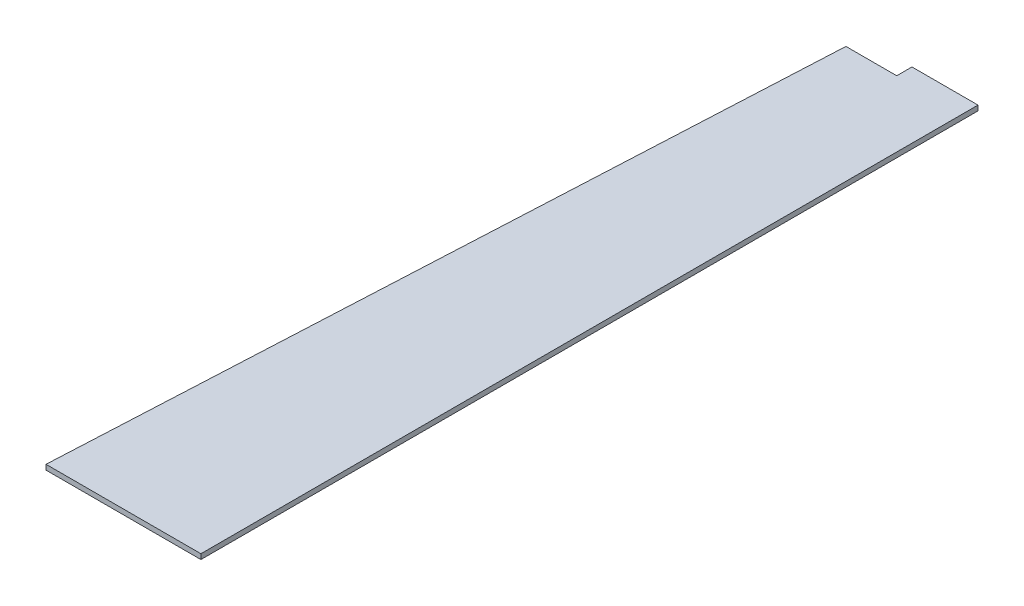
ISO-10303-21;
HEADER;
FILE_DESCRIPTION(('STEP AP214'),'2;1');
FILE_NAME('part.step','',(''),(''),'','','');
FILE_SCHEMA(('AUTOMOTIVE_DESIGN { 1 0 10303 214 1 1 1 1 }'));
ENDSEC;
DATA;
#1=APPLICATION_CONTEXT('core data for automotive mechanical design processes');
#2=APPLICATION_PROTOCOL_DEFINITION('international standard','automotive_design',2000,#1);
#3=PRODUCT_CONTEXT('',#1,'mechanical');
#4=PRODUCT('Part','Part','',(#3));
#5=PRODUCT_RELATED_PRODUCT_CATEGORY('part','',(#4));
#6=PRODUCT_DEFINITION_FORMATION('','',#4);
#7=PRODUCT_DEFINITION_CONTEXT('part definition',#1,'design');
#8=PRODUCT_DEFINITION('design','',#6,#7);
#9=PRODUCT_DEFINITION_SHAPE('','',#8);
#10=(LENGTH_UNIT() NAMED_UNIT(*) SI_UNIT(.MILLI.,.METRE.));
#11=(NAMED_UNIT(*) PLANE_ANGLE_UNIT() SI_UNIT($,.RADIAN.));
#12=(NAMED_UNIT(*) SI_UNIT($,.STERADIAN.) SOLID_ANGLE_UNIT());
#13=UNCERTAINTY_MEASURE_WITH_UNIT(LENGTH_MEASURE(1.E-05),#10,'distance_accuracy_value','');
#14=(GEOMETRIC_REPRESENTATION_CONTEXT(3) GLOBAL_UNCERTAINTY_ASSIGNED_CONTEXT((#13)) GLOBAL_UNIT_ASSIGNED_CONTEXT((#10,
#11,#12)) REPRESENTATION_CONTEXT('',''));
#15=CARTESIAN_POINT('',(0.,0.,0.));
#16=DIRECTION('',(0.,0.,1.));
#17=DIRECTION('',(1.,0.,0.));
#18=AXIS2_PLACEMENT_3D('',#15,#16,#17);
#19=CARTESIAN_POINT('',(630.,10.,0.));
#20=DIRECTION('',(0.,0.,-1.));
#21=DIRECTION('',(-1.,0.,0.));
#22=AXIS2_PLACEMENT_3D('',#19,#20,#21);
#23=PLANE('',#22);
#24=DIRECTION('',(1.,0.,0.));
#25=VECTOR('',#24,1.);
#26=CARTESIAN_POINT('',(630.,0.,0.));
#27=LINE('',#26,#25);
#28=CARTESIAN_POINT('',(325.,0.,0.));
#29=VERTEX_POINT('',#28);
#30=CARTESIAN_POINT('',(630.,0.,0.));
#31=VERTEX_POINT('',#30);
#32=EDGE_CURVE('E115',#29,#31,#27,.T.);
#33=ORIENTED_EDGE('',*,*,#32,.T.);
#34=DIRECTION('',(0.,-1.,0.));
#35=VECTOR('',#34,1.);
#36=CARTESIAN_POINT('',(630.,10.,0.));
#37=LINE('',#36,#35);
#38=CARTESIAN_POINT('',(630.,10.,0.));
#39=VERTEX_POINT('',#38);
#40=EDGE_CURVE('E11',#39,#31,#37,.T.);
#41=ORIENTED_EDGE('',*,*,#40,.F.);
#42=DIRECTION('',(1.,0.,0.));
#43=VECTOR('',#42,1.);
#44=CARTESIAN_POINT('',(630.,10.,0.));
#45=LINE('',#44,#43);
#46=CARTESIAN_POINT('',(325.,10.,0.));
#47=VERTEX_POINT('',#46);
#48=EDGE_CURVE('E125',#47,#39,#45,.T.);
#49=ORIENTED_EDGE('',*,*,#48,.F.);
#50=DIRECTION('',(0.,-1.,0.));
#51=VECTOR('',#50,1.);
#52=CARTESIAN_POINT('',(325.,10.,0.));
#53=LINE('',#52,#51);
#54=EDGE_CURVE('E111',#47,#29,#53,.T.);
#55=ORIENTED_EDGE('',*,*,#54,.T.);
#56=EDGE_LOOP('',(#33,#41,#49,#55));
#57=FACE_BOUND('',#56,.T.);
#58=ADVANCED_FACE('F31',(#57),#23,.F.);
#59=CARTESIAN_POINT('',(630.,10.,-1530.));
#60=DIRECTION('',(-1.,0.,0.));
#61=DIRECTION('',(0.,0.,1.));
#62=AXIS2_PLACEMENT_3D('',#59,#60,#61);
#63=PLANE('',#62);
#64=DIRECTION('',(0.,0.,-1.));
#65=VECTOR('',#64,1.);
#66=CARTESIAN_POINT('',(630.,0.,-1530.));
#67=LINE('',#66,#65);
#68=CARTESIAN_POINT('',(630.,0.,-1530.));
#69=VERTEX_POINT('',#68);
#70=EDGE_CURVE('E118',#31,#69,#67,.T.);
#71=ORIENTED_EDGE('',*,*,#70,.T.);
#72=DIRECTION('',(0.,-1.,0.));
#73=VECTOR('',#72,1.);
#74=CARTESIAN_POINT('',(630.,10.,-1530.));
#75=LINE('',#74,#73);
#76=CARTESIAN_POINT('',(630.,10.,-1530.));
#77=VERTEX_POINT('',#76);
#78=EDGE_CURVE('E39',#77,#69,#75,.T.);
#79=ORIENTED_EDGE('',*,*,#78,.F.);
#80=DIRECTION('',(0.,0.,-1.));
#81=VECTOR('',#80,1.);
#82=CARTESIAN_POINT('',(630.,10.,-1530.));
#83=LINE('',#82,#81);
#84=EDGE_CURVE('E84',#39,#77,#83,.T.);
#85=ORIENTED_EDGE('',*,*,#84,.F.);
#86=ORIENTED_EDGE('',*,*,#40,.T.);
#87=EDGE_LOOP('',(#71,#79,#85,#86));
#88=FACE_BOUND('',#87,.T.);
#89=ADVANCED_FACE('F149',(#88),#63,.F.);
#90=CARTESIAN_POINT('',(500.,10.,-1530.));
#91=DIRECTION('',(0.,0.,1.));
#92=DIRECTION('',(1.,0.,0.));
#93=AXIS2_PLACEMENT_3D('',#90,#91,#92);
#94=PLANE('',#93);
#95=DIRECTION('',(-1.,0.,0.));
#96=VECTOR('',#95,1.);
#97=CARTESIAN_POINT('',(500.,0.,-1530.));
#98=LINE('',#97,#96);
#99=CARTESIAN_POINT('',(500.,0.,-1530.));
#100=VERTEX_POINT('',#99);
#101=EDGE_CURVE('E120',#69,#100,#98,.T.);
#102=ORIENTED_EDGE('',*,*,#101,.T.);
#103=DIRECTION('',(0.,-1.,0.));
#104=VECTOR('',#103,1.);
#105=CARTESIAN_POINT('',(500.,10.,-1530.));
#106=LINE('',#105,#104);
#107=CARTESIAN_POINT('',(500.,10.,-1530.));
#108=VERTEX_POINT('',#107);
#109=EDGE_CURVE('E106',#108,#100,#106,.T.);
#110=ORIENTED_EDGE('',*,*,#109,.F.);
#111=DIRECTION('',(-1.,0.,0.));
#112=VECTOR('',#111,1.);
#113=CARTESIAN_POINT('',(500.,10.,-1530.));
#114=LINE('',#113,#112);
#115=EDGE_CURVE('E97',#77,#108,#114,.T.);
#116=ORIENTED_EDGE('',*,*,#115,.F.);
#117=ORIENTED_EDGE('',*,*,#78,.T.);
#118=EDGE_LOOP('',(#102,#110,#116,#117));
#119=FACE_BOUND('',#118,.T.);
#120=ADVANCED_FACE('F131',(#119),#94,.F.);
#121=CARTESIAN_POINT('',(500.,10.,-1500.));
#122=DIRECTION('',(1.,0.,0.));
#123=DIRECTION('',(0.,0.,-1.));
#124=AXIS2_PLACEMENT_3D('',#121,#122,#123);
#125=PLANE('',#124);
#126=DIRECTION('',(0.,0.,1.));
#127=VECTOR('',#126,1.);
#128=CARTESIAN_POINT('',(500.,0.,-1500.));
#129=LINE('',#128,#127);
#130=CARTESIAN_POINT('',(500.,0.,-1500.));
#131=VERTEX_POINT('',#130);
#132=EDGE_CURVE('E105',#100,#131,#129,.T.);
#133=ORIENTED_EDGE('',*,*,#132,.T.);
#134=DIRECTION('',(0.,-1.,0.));
#135=VECTOR('',#134,1.);
#136=CARTESIAN_POINT('',(500.,10.,-1500.));
#137=LINE('',#136,#135);
#138=CARTESIAN_POINT('',(500.,10.,-1500.));
#139=VERTEX_POINT('',#138);
#140=EDGE_CURVE('E102',#139,#131,#137,.T.);
#141=ORIENTED_EDGE('',*,*,#140,.F.);
#142=DIRECTION('',(0.,0.,1.));
#143=VECTOR('',#142,1.);
#144=CARTESIAN_POINT('',(500.,10.,-1500.));
#145=LINE('',#144,#143);
#146=EDGE_CURVE('E91',#108,#139,#145,.T.);
#147=ORIENTED_EDGE('',*,*,#146,.F.);
#148=ORIENTED_EDGE('',*,*,#109,.T.);
#149=EDGE_LOOP('',(#133,#141,#147,#148));
#150=FACE_BOUND('',#149,.T.);
#151=ADVANCED_FACE('F103',(#150),#125,.F.);
#152=CARTESIAN_POINT('',(400.,10.,-1500.));
#153=DIRECTION('',(0.,0.,1.));
#154=DIRECTION('',(1.,0.,0.));
#155=AXIS2_PLACEMENT_3D('',#152,#153,#154);
#156=PLANE('',#155);
#157=DIRECTION('',(-1.,0.,0.));
#158=VECTOR('',#157,1.);
#159=CARTESIAN_POINT('',(400.,0.,-1500.));
#160=LINE('',#159,#158);
#161=CARTESIAN_POINT('',(400.,0.,-1500.));
#162=VERTEX_POINT('',#161);
#163=EDGE_CURVE('E70',#131,#162,#160,.T.);
#164=ORIENTED_EDGE('',*,*,#163,.T.);
#165=DIRECTION('',(0.,-1.,0.));
#166=VECTOR('',#165,1.);
#167=CARTESIAN_POINT('',(400.,10.,-1500.));
#168=LINE('',#167,#166);
#169=CARTESIAN_POINT('',(400.,10.,-1500.));
#170=VERTEX_POINT('',#169);
#171=EDGE_CURVE('E107',#170,#162,#168,.T.);
#172=ORIENTED_EDGE('',*,*,#171,.F.);
#173=DIRECTION('',(-1.,0.,0.));
#174=VECTOR('',#173,1.);
#175=CARTESIAN_POINT('',(400.,10.,-1500.));
#176=LINE('',#175,#174);
#177=EDGE_CURVE('E95',#139,#170,#176,.T.);
#178=ORIENTED_EDGE('',*,*,#177,.F.);
#179=ORIENTED_EDGE('',*,*,#140,.T.);
#180=EDGE_LOOP('',(#164,#172,#178,#179));
#181=FACE_BOUND('',#180,.T.);
#182=ADVANCED_FACE('F109',(#181),#156,.F.);
#183=CARTESIAN_POINT('',(325.,10.,0.));
#184=DIRECTION('',(0.998752338877845,0.,0.0499376169438922));
#185=DIRECTION('',(0.0499376169438923,0.,-0.998752338877845));
#186=AXIS2_PLACEMENT_3D('',#183,#184,#185);
#187=PLANE('',#186);
#188=DIRECTION('',(-0.0499376169438922,0.,0.998752338877845));
#189=VECTOR('',#188,1.);
#190=CARTESIAN_POINT('',(325.,0.,0.));
#191=LINE('',#190,#189);
#192=EDGE_CURVE('E76',#162,#29,#191,.T.);
#193=ORIENTED_EDGE('',*,*,#192,.T.);
#194=ORIENTED_EDGE('',*,*,#54,.F.);
#195=DIRECTION('',(-0.0499376169438922,0.,0.998752338877845));
#196=VECTOR('',#195,1.);
#197=CARTESIAN_POINT('',(325.,10.,0.));
#198=LINE('',#197,#196);
#199=EDGE_CURVE('E47',#170,#47,#198,.T.);
#200=ORIENTED_EDGE('',*,*,#199,.F.);
#201=ORIENTED_EDGE('',*,*,#171,.T.);
#202=EDGE_LOOP('',(#193,#194,#200,#201));
#203=FACE_BOUND('',#202,.T.);
#204=ADVANCED_FACE('F138',(#203),#187,.F.);
#205=CARTESIAN_POINT('',(500.,10.,0.));
#206=DIRECTION('',(0.,-1.,0.));
#207=DIRECTION('',(0.,0.,-1.));
#208=AXIS2_PLACEMENT_3D('',#205,#206,#207);
#209=PLANE('',#208);
#210=ORIENTED_EDGE('',*,*,#48,.T.);
#211=ORIENTED_EDGE('',*,*,#84,.T.);
#212=ORIENTED_EDGE('',*,*,#115,.T.);
#213=ORIENTED_EDGE('',*,*,#146,.T.);
#214=ORIENTED_EDGE('',*,*,#177,.T.);
#215=ORIENTED_EDGE('',*,*,#199,.T.);
#216=EDGE_LOOP('',(#210,#211,#212,#213,#214,#215));
#217=FACE_BOUND('',#216,.T.);
#218=ADVANCED_FACE('F93',(#217),#209,.F.);
#219=CARTESIAN_POINT('',(500.,0.,0.));
#220=DIRECTION('',(0.,-1.,0.));
#221=DIRECTION('',(0.,0.,-1.));
#222=AXIS2_PLACEMENT_3D('',#219,#220,#221);
#223=PLANE('',#222);
#224=ORIENTED_EDGE('',*,*,#32,.F.);
#225=ORIENTED_EDGE('',*,*,#192,.F.);
#226=ORIENTED_EDGE('',*,*,#163,.F.);
#227=ORIENTED_EDGE('',*,*,#132,.F.);
#228=ORIENTED_EDGE('',*,*,#101,.F.);
#229=ORIENTED_EDGE('',*,*,#70,.F.);
#230=EDGE_LOOP('',(#224,#225,#226,#227,#228,#229));
#231=FACE_BOUND('',#230,.T.);
#232=ADVANCED_FACE('F134',(#231),#223,.T.);
#233=CLOSED_SHELL('',(#58,#89,#120,#151,#182,#204,#218,#232));
#234=MANIFOLD_SOLID_BREP('B2',#233);
#235=ADVANCED_BREP_SHAPE_REPRESENTATION('',(#18,#234),#14);
#236=SHAPE_DEFINITION_REPRESENTATION(#9,#235);
ENDSEC;
END-ISO-10303-21;
